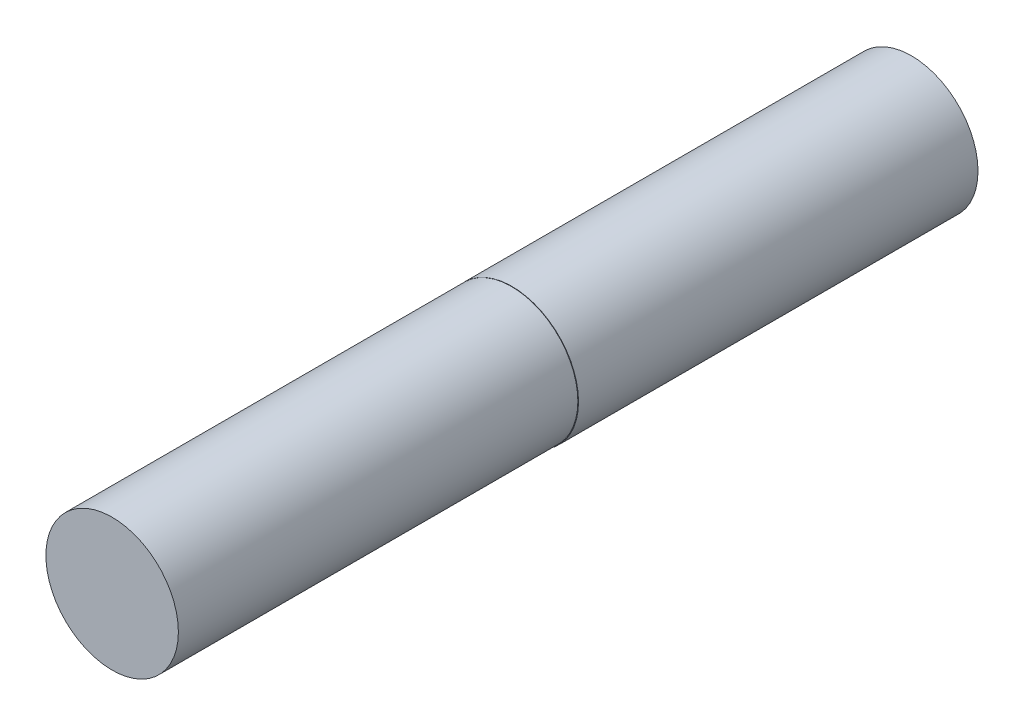
ISO-10303-21;
HEADER;
FILE_DESCRIPTION(('STEP AP214'),'2;1');
FILE_NAME('part.step','',(''),(''),'','','');
FILE_SCHEMA(('AUTOMOTIVE_DESIGN { 1 0 10303 214 1 1 1 1 }'));
ENDSEC;
DATA;
#1=APPLICATION_CONTEXT('core data for automotive mechanical design processes');
#2=APPLICATION_PROTOCOL_DEFINITION('international standard','automotive_design',2000,#1);
#3=PRODUCT_CONTEXT('',#1,'mechanical');
#4=PRODUCT('Part','Part','',(#3));
#5=PRODUCT_RELATED_PRODUCT_CATEGORY('part','',(#4));
#6=PRODUCT_DEFINITION_FORMATION('','',#4);
#7=PRODUCT_DEFINITION_CONTEXT('part definition',#1,'design');
#8=PRODUCT_DEFINITION('design','',#6,#7);
#9=PRODUCT_DEFINITION_SHAPE('','',#8);
#10=(LENGTH_UNIT() NAMED_UNIT(*) SI_UNIT(.MILLI.,.METRE.));
#11=(NAMED_UNIT(*) PLANE_ANGLE_UNIT() SI_UNIT($,.RADIAN.));
#12=(NAMED_UNIT(*) SI_UNIT($,.STERADIAN.) SOLID_ANGLE_UNIT());
#13=UNCERTAINTY_MEASURE_WITH_UNIT(LENGTH_MEASURE(1.E-05),#10,'distance_accuracy_value','');
#14=(GEOMETRIC_REPRESENTATION_CONTEXT(3) GLOBAL_UNCERTAINTY_ASSIGNED_CONTEXT((#13)) GLOBAL_UNIT_ASSIGNED_CONTEXT((#10,
#11,#12)) REPRESENTATION_CONTEXT('',''));
#15=CARTESIAN_POINT('',(0.,0.,0.));
#16=DIRECTION('',(0.,0.,1.));
#17=DIRECTION('',(1.,0.,0.));
#18=AXIS2_PLACEMENT_3D('',#15,#16,#17);
#19=CARTESIAN_POINT('',(0.,-1.5,30.));
#20=DIRECTION('',(0.,1.,0.));
#21=DIRECTION('',(0.,0.,1.));
#22=AXIS2_PLACEMENT_3D('',#19,#20,#21);
#23=PLANE('',#22);
#24=DIRECTION('',(1.,0.,0.));
#25=VECTOR('',#24,1.);
#26=CARTESIAN_POINT('',(0.,-1.5,0.));
#27=LINE('',#26,#25);
#28=CARTESIAN_POINT('',(-4.74485662665233,-1.5,0.));
#29=VERTEX_POINT('',#28);
#30=CARTESIAN_POINT('',(-1.9751606195676,-1.5,0.));
#31=VERTEX_POINT('',#30);
#32=EDGE_CURVE('E119',#29,#31,#27,.T.);
#33=ORIENTED_EDGE('',*,*,#32,.F.);
#34=DIRECTION('',(0.,0.,-1.));
#35=VECTOR('',#34,1.);
#36=CARTESIAN_POINT('',(-4.74485662665233,-1.5,30.));
#37=LINE('',#36,#35);
#38=CARTESIAN_POINT('',(-4.74485662665233,-1.5,30.));
#39=VERTEX_POINT('',#38);
#40=EDGE_CURVE('E44',#39,#29,#37,.T.);
#41=ORIENTED_EDGE('',*,*,#40,.F.);
#42=DIRECTION('',(1.,0.,0.));
#43=VECTOR('',#42,1.);
#44=CARTESIAN_POINT('',(0.,-1.5,30.));
#45=LINE('',#44,#43);
#46=CARTESIAN_POINT('',(-4.74365082931871,-1.5,30.));
#47=VERTEX_POINT('',#46);
#48=EDGE_CURVE('E122',#39,#47,#45,.T.);
#49=ORIENTED_EDGE('',*,*,#48,.T.);
#50=CARTESIAN_POINT('',(-1.9751606195676,-1.5,30.));
#51=VERTEX_POINT('',#50);
#52=EDGE_CURVE('E64',#47,#51,#45,.T.);
#53=ORIENTED_EDGE('',*,*,#52,.T.);
#54=DIRECTION('',(0.,0.,-1.));
#55=VECTOR('',#54,1.);
#56=CARTESIAN_POINT('',(-1.9751606195676,-1.5,30.));
#57=LINE('',#56,#55);
#58=EDGE_CURVE('E83',#51,#31,#57,.T.);
#59=ORIENTED_EDGE('',*,*,#58,.T.);
#60=EDGE_LOOP('',(#33,#41,#49,#53,#59));
#61=FACE_BOUND('',#60,.T.);
#62=ADVANCED_FACE('F41',(#61),#23,.T.);
#63=CARTESIAN_POINT('',(0.0248393804323961,0.,30.));
#64=DIRECTION('',(0.,0.,-1.));
#65=DIRECTION('',(-1.,0.,0.));
#66=AXIS2_PLACEMENT_3D('',#63,#64,#65);
#67=CYLINDRICAL_SURFACE('',#66,5.);
#68=CARTESIAN_POINT('',(0.0248393804323961,0.,0.));
#69=DIRECTION('',(0.,0.,1.));
#70=DIRECTION('',(1.,0.,0.));
#71=AXIS2_PLACEMENT_3D('',#68,#69,#70);
#72=CIRCLE('',#71,5.);
#73=CARTESIAN_POINT('',(-4.74485662665233,1.5,0.));
#74=VERTEX_POINT('',#73);
#75=EDGE_CURVE('E132',#29,#74,#72,.T.);
#76=ORIENTED_EDGE('',*,*,#75,.T.);
#77=DIRECTION('',(0.,0.,-1.));
#78=VECTOR('',#77,1.);
#79=CARTESIAN_POINT('',(-4.74485662665233,1.5,30.));
#80=LINE('',#79,#78);
#81=CARTESIAN_POINT('',(-4.74485662665233,1.5,30.));
#82=VERTEX_POINT('',#81);
#83=EDGE_CURVE('E144',#82,#74,#80,.T.);
#84=ORIENTED_EDGE('',*,*,#83,.F.);
#85=CARTESIAN_POINT('',(0.0248393804323961,0.,30.));
#86=DIRECTION('',(0.,0.,1.));
#87=DIRECTION('',(1.,0.,0.));
#88=AXIS2_PLACEMENT_3D('',#85,#86,#87);
#89=CIRCLE('',#88,5.);
#90=EDGE_CURVE('E94',#39,#82,#89,.T.);
#91=ORIENTED_EDGE('',*,*,#90,.F.);
#92=ORIENTED_EDGE('',*,*,#40,.T.);
#93=EDGE_LOOP('',(#76,#84,#91,#92));
#94=FACE_BOUND('',#93,.T.);
#95=ADVANCED_FACE('F150',(#94),#67,.T.);
#96=CARTESIAN_POINT('',(0.,1.5,30.));
#97=DIRECTION('',(0.,1.,0.));
#98=DIRECTION('',(0.,0.,1.));
#99=AXIS2_PLACEMENT_3D('',#96,#97,#98);
#100=PLANE('',#99);
#101=DIRECTION('',(1.,0.,0.));
#102=VECTOR('',#101,1.);
#103=CARTESIAN_POINT('',(0.,1.5,0.));
#104=LINE('',#103,#102);
#105=CARTESIAN_POINT('',(-1.9751606195676,1.5,0.));
#106=VERTEX_POINT('',#105);
#107=EDGE_CURVE('E135',#74,#106,#104,.T.);
#108=ORIENTED_EDGE('',*,*,#107,.T.);
#109=DIRECTION('',(0.,0.,-1.));
#110=VECTOR('',#109,1.);
#111=CARTESIAN_POINT('',(-1.9751606195676,1.5,30.));
#112=LINE('',#111,#110);
#113=CARTESIAN_POINT('',(-1.9751606195676,1.5,30.));
#114=VERTEX_POINT('',#113);
#115=EDGE_CURVE('E105',#114,#106,#112,.T.);
#116=ORIENTED_EDGE('',*,*,#115,.F.);
#117=DIRECTION('',(1.,0.,0.));
#118=VECTOR('',#117,1.);
#119=CARTESIAN_POINT('',(0.,1.5,30.));
#120=LINE('',#119,#118);
#121=CARTESIAN_POINT('',(-4.74365082931871,1.5,30.));
#122=VERTEX_POINT('',#121);
#123=EDGE_CURVE('E100',#122,#114,#120,.T.);
#124=ORIENTED_EDGE('',*,*,#123,.F.);
#125=EDGE_CURVE('E91',#82,#122,#120,.T.);
#126=ORIENTED_EDGE('',*,*,#125,.F.);
#127=ORIENTED_EDGE('',*,*,#83,.T.);
#128=EDGE_LOOP('',(#108,#116,#124,#126,#127));
#129=FACE_BOUND('',#128,.T.);
#130=ADVANCED_FACE('F103',(#129),#100,.F.);
#131=CARTESIAN_POINT('',(-1.9751606195676,0.,30.));
#132=DIRECTION('',(1.,0.,0.));
#133=DIRECTION('',(0.,0.,-1.));
#134=AXIS2_PLACEMENT_3D('',#131,#132,#133);
#135=PLANE('',#134);
#136=DIRECTION('',(0.,-1.,0.));
#137=VECTOR('',#136,1.);
#138=CARTESIAN_POINT('',(-1.9751606195676,0.,0.));
#139=LINE('',#138,#137);
#140=EDGE_CURVE('E138',#106,#31,#139,.T.);
#141=ORIENTED_EDGE('',*,*,#140,.T.);
#142=ORIENTED_EDGE('',*,*,#58,.F.);
#143=DIRECTION('',(0.,-1.,0.));
#144=VECTOR('',#143,1.);
#145=CARTESIAN_POINT('',(-1.9751606195676,0.,30.));
#146=LINE('',#145,#144);
#147=EDGE_CURVE('E99',#114,#51,#146,.T.);
#148=ORIENTED_EDGE('',*,*,#147,.F.);
#149=ORIENTED_EDGE('',*,*,#115,.T.);
#150=EDGE_LOOP('',(#141,#142,#148,#149));
#151=FACE_BOUND('',#150,.T.);
#152=ADVANCED_FACE('F161',(#151),#135,.F.);
#153=CARTESIAN_POINT('',(0.,0.,30.));
#154=DIRECTION('',(0.,0.,1.));
#155=DIRECTION('',(1.,0.,0.));
#156=AXIS2_PLACEMENT_3D('',#153,#154,#155);
#157=PLANE('',#156);
#158=CARTESIAN_POINT('',(0.,0.,30.));
#159=DIRECTION('',(0.,0.,1.));
#160=DIRECTION('',(1.,0.,0.));
#161=AXIS2_PLACEMENT_3D('',#158,#159,#160);
#162=CIRCLE('',#161,4.97516061956758);
#163=EDGE_CURVE('E11',#47,#122,#162,.T.);
#164=ORIENTED_EDGE('',*,*,#163,.F.);
#165=ORIENTED_EDGE('',*,*,#48,.F.);
#166=ORIENTED_EDGE('',*,*,#90,.T.);
#167=ORIENTED_EDGE('',*,*,#125,.T.);
#168=EDGE_LOOP('',(#164,#165,#166,#167));
#169=FACE_BOUND('',#168,.T.);
#170=ADVANCED_FACE('F93',(#169),#157,.T.);
#171=CARTESIAN_POINT('',(0.,0.,0.));
#172=DIRECTION('',(0.,0.,1.));
#173=DIRECTION('',(1.,0.,0.));
#174=AXIS2_PLACEMENT_3D('',#171,#172,#173);
#175=PLANE('',#174);
#176=ORIENTED_EDGE('',*,*,#32,.T.);
#177=ORIENTED_EDGE('',*,*,#140,.F.);
#178=ORIENTED_EDGE('',*,*,#107,.F.);
#179=ORIENTED_EDGE('',*,*,#75,.F.);
#180=EDGE_LOOP('',(#176,#177,#178,#179));
#181=FACE_BOUND('',#180,.T.);
#182=ADVANCED_FACE('F152',(#181),#175,.F.);
#183=CARTESIAN_POINT('',(0.,0.,60.));
#184=DIRECTION('',(0.,0.,-1.));
#185=DIRECTION('',(-1.,0.,0.));
#186=AXIS2_PLACEMENT_3D('',#183,#184,#185);
#187=CYLINDRICAL_SURFACE('',#186,4.97516061956758);
#188=CARTESIAN_POINT('',(0.,0.,60.));
#189=DIRECTION('',(0.,0.,1.));
#190=DIRECTION('',(1.,0.,0.));
#191=AXIS2_PLACEMENT_3D('',#188,#189,#190);
#192=CIRCLE('',#191,4.97516061956758);
#193=CARTESIAN_POINT('',(4.97516061956758,0.,60.));
#194=VERTEX_POINT('',#193);
#195=EDGE_CURVE('E116',#194,#194,#192,.T.);
#196=ORIENTED_EDGE('',*,*,#195,.F.);
#197=EDGE_LOOP('',(#196));
#198=FACE_BOUND('',#197,.T.);
#199=EDGE_CURVE('E51',#122,#47,#162,.T.);
#200=ORIENTED_EDGE('',*,*,#199,.T.);
#201=ORIENTED_EDGE('',*,*,#163,.T.);
#202=EDGE_LOOP('',(#200,#201));
#203=FACE_BOUND('',#202,.T.);
#204=ADVANCED_FACE('F113',(#198,#203),#187,.T.);
#205=CARTESIAN_POINT('',(0.,0.,60.));
#206=DIRECTION('',(0.,0.,1.));
#207=DIRECTION('',(1.,0.,0.));
#208=AXIS2_PLACEMENT_3D('',#205,#206,#207);
#209=PLANE('',#208);
#210=ORIENTED_EDGE('',*,*,#195,.T.);
#211=EDGE_LOOP('',(#210));
#212=FACE_BOUND('',#211,.T.);
#213=ADVANCED_FACE('F173',(#212),#209,.T.);
#214=CARTESIAN_POINT('',(0.,0.,30.));
#215=DIRECTION('',(0.,0.,1.));
#216=DIRECTION('',(1.,0.,0.));
#217=AXIS2_PLACEMENT_3D('',#214,#215,#216);
#218=PLANE('',#217);
#219=ORIENTED_EDGE('',*,*,#52,.F.);
#220=ORIENTED_EDGE('',*,*,#199,.F.);
#221=ORIENTED_EDGE('',*,*,#123,.T.);
#222=ORIENTED_EDGE('',*,*,#147,.T.);
#223=EDGE_LOOP('',(#219,#220,#221,#222));
#224=FACE_BOUND('',#223,.T.);
#225=ADVANCED_FACE('F114',(#224),#218,.F.);
#226=CLOSED_SHELL('',(#62,#95,#130,#152,#170,#182,#204,#213,#225));
#227=MANIFOLD_SOLID_BREP('B2',#226);
#228=ADVANCED_BREP_SHAPE_REPRESENTATION('',(#18,#227),#14);
#229=SHAPE_DEFINITION_REPRESENTATION(#9,#228);
ENDSEC;
END-ISO-10303-21;
